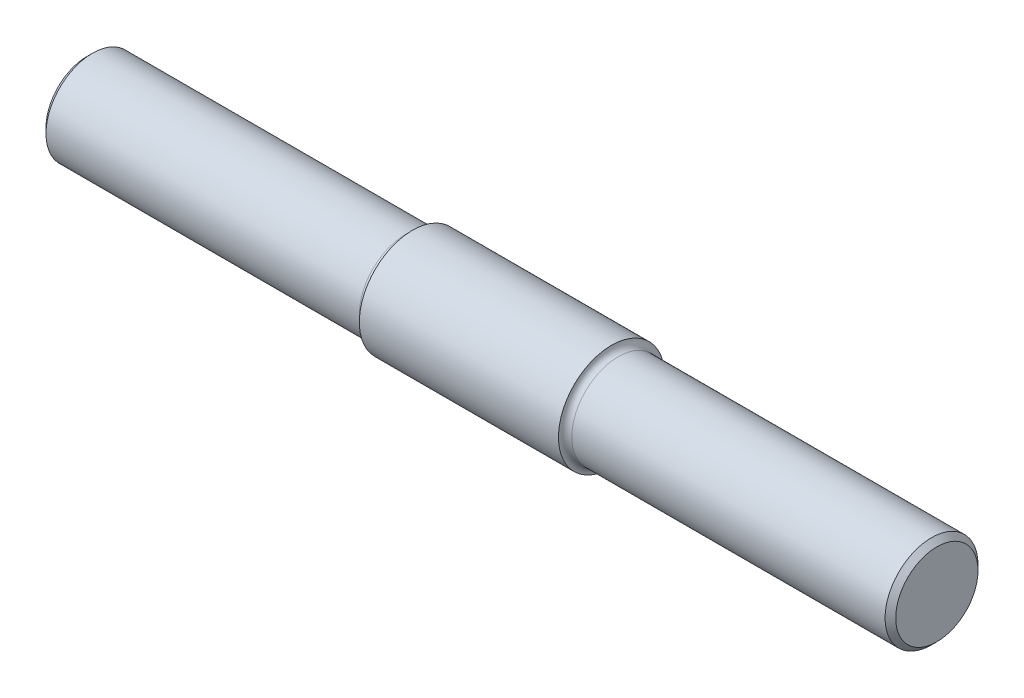
ISO-10303-21;
HEADER;
FILE_DESCRIPTION(('STEP AP214'),'2;1');
FILE_NAME('part.step','',(''),(''),'','','');
FILE_SCHEMA(('AUTOMOTIVE_DESIGN { 1 0 10303 214 1 1 1 1 }'));
ENDSEC;
DATA;
#1=APPLICATION_CONTEXT('core data for automotive mechanical design processes');
#2=APPLICATION_PROTOCOL_DEFINITION('international standard','automotive_design',2000,#1);
#3=PRODUCT_CONTEXT('',#1,'mechanical');
#4=PRODUCT('Part','Part','',(#3));
#5=PRODUCT_RELATED_PRODUCT_CATEGORY('part','',(#4));
#6=PRODUCT_DEFINITION_FORMATION('','',#4);
#7=PRODUCT_DEFINITION_CONTEXT('part definition',#1,'design');
#8=PRODUCT_DEFINITION('design','',#6,#7);
#9=PRODUCT_DEFINITION_SHAPE('','',#8);
#10=(LENGTH_UNIT() NAMED_UNIT(*) SI_UNIT(.MILLI.,.METRE.));
#11=(NAMED_UNIT(*) PLANE_ANGLE_UNIT() SI_UNIT($,.RADIAN.));
#12=(NAMED_UNIT(*) SI_UNIT($,.STERADIAN.) SOLID_ANGLE_UNIT());
#13=UNCERTAINTY_MEASURE_WITH_UNIT(LENGTH_MEASURE(1.E-05),#10,'distance_accuracy_value','');
#14=(GEOMETRIC_REPRESENTATION_CONTEXT(3) GLOBAL_UNCERTAINTY_ASSIGNED_CONTEXT((#13)) GLOBAL_UNIT_ASSIGNED_CONTEXT((#10,
#11,#12)) REPRESENTATION_CONTEXT('',''));
#15=CARTESIAN_POINT('',(0.,0.,0.));
#16=DIRECTION('',(0.,0.,1.));
#17=DIRECTION('',(1.,0.,0.));
#18=AXIS2_PLACEMENT_3D('',#15,#16,#17);
#19=CARTESIAN_POINT('',(-50.8,0.,0.));
#20=DIRECTION('',(-1.,0.,0.));
#21=DIRECTION('',(0.,0.,1.));
#22=AXIS2_PLACEMENT_3D('',#19,#20,#21);
#23=PLANE('',#22);
#24=CARTESIAN_POINT('',(-50.8,0.,0.));
#25=DIRECTION('',(-1.,0.,0.));
#26=DIRECTION('',(0.,0.,1.));
#27=AXIS2_PLACEMENT_3D('',#24,#25,#26);
#28=CIRCLE('',#27,4.92125000000001);
#29=CARTESIAN_POINT('',(-50.8,0.,4.92125000000001));
#30=VERTEX_POINT('',#29);
#31=EDGE_CURVE('E10',#30,#30,#28,.T.);
#32=ORIENTED_EDGE('',*,*,#31,.T.);
#33=EDGE_LOOP('',(#32));
#34=FACE_BOUND('',#33,.T.);
#35=ADVANCED_FACE('F32',(#34),#23,.T.);
#36=CARTESIAN_POINT('',(50.8,5.55625000000001,0.));
#37=DIRECTION('',(1.,0.,0.));
#38=DIRECTION('',(0.,0.,-1.));
#39=AXIS2_PLACEMENT_3D('',#36,#37,#38);
#40=PLANE('',#39);
#41=CARTESIAN_POINT('',(50.8,0.,0.));
#42=DIRECTION('',(1.,0.,0.));
#43=DIRECTION('',(0.,0.,-1.));
#44=AXIS2_PLACEMENT_3D('',#41,#42,#43);
#45=CIRCLE('',#44,4.92125000000002);
#46=CARTESIAN_POINT('',(50.8,0.,-4.92125000000002));
#47=VERTEX_POINT('',#46);
#48=EDGE_CURVE('E47',#47,#47,#45,.T.);
#49=ORIENTED_EDGE('',*,*,#48,.T.);
#50=EDGE_LOOP('',(#49));
#51=FACE_BOUND('',#50,.T.);
#52=ADVANCED_FACE('F80',(#51),#40,.T.);
#53=CARTESIAN_POINT('',(-50.8,0.,0.));
#54=DIRECTION('',(1.,0.,0.));
#55=DIRECTION('',(0.,0.,-1.));
#56=AXIS2_PLACEMENT_3D('',#53,#54,#55);
#57=CYLINDRICAL_SURFACE('',#56,5.55625);
#58=CARTESIAN_POINT('',(50.165,0.,0.));
#59=DIRECTION('',(1.,0.,0.));
#60=DIRECTION('',(0.,0.,-1.));
#61=AXIS2_PLACEMENT_3D('',#58,#59,#60);
#62=CIRCLE('',#61,5.55625);
#63=CARTESIAN_POINT('',(50.165,0.,-5.55625));
#64=VERTEX_POINT('',#63);
#65=EDGE_CURVE('E43',#64,#64,#62,.F.);
#66=ORIENTED_EDGE('',*,*,#65,.T.);
#67=EDGE_LOOP('',(#66));
#68=FACE_BOUND('',#67,.T.);
#69=CARTESIAN_POINT('',(12.7,0.,0.));
#70=DIRECTION('',(1.,0.,0.));
#71=DIRECTION('',(0.,0.,-1.));
#72=AXIS2_PLACEMENT_3D('',#69,#70,#71);
#73=CIRCLE('',#72,5.55625);
#74=CARTESIAN_POINT('',(12.7,0.,-5.55625));
#75=VERTEX_POINT('',#74);
#76=EDGE_CURVE('E52',#75,#75,#73,.T.);
#77=ORIENTED_EDGE('',*,*,#76,.T.);
#78=EDGE_LOOP('',(#77));
#79=FACE_BOUND('',#78,.T.);
#80=ADVANCED_FACE('F85',(#68,#79),#57,.T.);
#81=CARTESIAN_POINT('',(12.7,0.,0.));
#82=DIRECTION('',(1.,0.,0.));
#83=DIRECTION('',(0.,0.,-1.));
#84=AXIS2_PLACEMENT_3D('',#81,#82,#83);
#85=TOROIDAL_SURFACE('',#84,6.35,0.793750000000004);
#86=CARTESIAN_POINT('',(11.90625,0.,0.));
#87=DIRECTION('',(1.,0.,0.));
#88=DIRECTION('',(0.,0.,-1.));
#89=AXIS2_PLACEMENT_3D('',#86,#87,#88);
#90=CIRCLE('',#89,6.35000000000001);
#91=CARTESIAN_POINT('',(11.90625,0.,-6.35000000000001));
#92=VERTEX_POINT('',#91);
#93=EDGE_CURVE('E55',#92,#92,#90,.T.);
#94=ORIENTED_EDGE('',*,*,#93,.T.);
#95=EDGE_LOOP('',(#94));
#96=FACE_BOUND('',#95,.T.);
#97=ORIENTED_EDGE('',*,*,#76,.F.);
#98=EDGE_LOOP('',(#97));
#99=FACE_BOUND('',#98,.T.);
#100=ADVANCED_FACE('F91',(#96,#99),#85,.F.);
#101=CARTESIAN_POINT('',(-50.8,0.,0.));
#102=DIRECTION('',(1.,0.,0.));
#103=DIRECTION('',(0.,0.,-1.));
#104=AXIS2_PLACEMENT_3D('',#101,#102,#103);
#105=CYLINDRICAL_SURFACE('',#104,6.35000000000001);
#106=CARTESIAN_POINT('',(-11.90625,0.,0.));
#107=DIRECTION('',(1.,0.,0.));
#108=DIRECTION('',(0.,0.,-1.));
#109=AXIS2_PLACEMENT_3D('',#106,#107,#108);
#110=CIRCLE('',#109,6.35000000000001);
#111=CARTESIAN_POINT('',(-11.90625,0.,-6.35000000000001));
#112=VERTEX_POINT('',#111);
#113=EDGE_CURVE('E58',#112,#112,#110,.T.);
#114=ORIENTED_EDGE('',*,*,#113,.T.);
#115=EDGE_LOOP('',(#114));
#116=FACE_BOUND('',#115,.T.);
#117=ORIENTED_EDGE('',*,*,#93,.F.);
#118=EDGE_LOOP('',(#117));
#119=FACE_BOUND('',#118,.T.);
#120=ADVANCED_FACE('F77',(#116,#119),#105,.T.);
#121=CARTESIAN_POINT('',(-12.7,0.,0.));
#122=DIRECTION('',(1.,0.,0.));
#123=DIRECTION('',(0.,0.,-1.));
#124=AXIS2_PLACEMENT_3D('',#121,#122,#123);
#125=TOROIDAL_SURFACE('',#124,6.35000000000001,0.793750000000004);
#126=CARTESIAN_POINT('',(-12.7,0.,0.));
#127=DIRECTION('',(1.,0.,0.));
#128=DIRECTION('',(0.,0.,-1.));
#129=AXIS2_PLACEMENT_3D('',#126,#127,#128);
#130=CIRCLE('',#129,5.55625);
#131=CARTESIAN_POINT('',(-12.7,0.,-5.55625));
#132=VERTEX_POINT('',#131);
#133=EDGE_CURVE('E61',#132,#132,#130,.T.);
#134=ORIENTED_EDGE('',*,*,#133,.T.);
#135=EDGE_LOOP('',(#134));
#136=FACE_BOUND('',#135,.T.);
#137=ORIENTED_EDGE('',*,*,#113,.F.);
#138=EDGE_LOOP('',(#137));
#139=FACE_BOUND('',#138,.T.);
#140=ADVANCED_FACE('F65',(#136,#139),#125,.F.);
#141=CARTESIAN_POINT('',(-50.8,0.,0.));
#142=DIRECTION('',(1.,0.,0.));
#143=DIRECTION('',(0.,0.,-1.));
#144=AXIS2_PLACEMENT_3D('',#141,#142,#143);
#145=CYLINDRICAL_SURFACE('',#144,5.55625000000001);
#146=CARTESIAN_POINT('',(-50.165,0.,0.));
#147=DIRECTION('',(-1.,0.,0.));
#148=DIRECTION('',(0.,0.,1.));
#149=AXIS2_PLACEMENT_3D('',#146,#147,#148);
#150=CIRCLE('',#149,5.55625000000001);
#151=CARTESIAN_POINT('',(-50.165,0.,5.55625000000001));
#152=VERTEX_POINT('',#151);
#153=EDGE_CURVE('E39',#152,#152,#150,.F.);
#154=ORIENTED_EDGE('',*,*,#153,.T.);
#155=EDGE_LOOP('',(#154));
#156=FACE_BOUND('',#155,.T.);
#157=ORIENTED_EDGE('',*,*,#133,.F.);
#158=EDGE_LOOP('',(#157));
#159=FACE_BOUND('',#158,.T.);
#160=ADVANCED_FACE('F68',(#156,#159),#145,.T.);
#161=CARTESIAN_POINT('',(50.8,0.,0.));
#162=DIRECTION('',(-1.,0.,0.));
#163=DIRECTION('',(0.,0.,1.));
#164=AXIS2_PLACEMENT_3D('',#161,#162,#163);
#165=CONICAL_SURFACE('',#164,4.92125000000002,0.785398163397441);
#166=ORIENTED_EDGE('',*,*,#65,.F.);
#167=EDGE_LOOP('',(#166));
#168=FACE_BOUND('',#167,.T.);
#169=ORIENTED_EDGE('',*,*,#48,.F.);
#170=EDGE_LOOP('',(#169));
#171=FACE_BOUND('',#170,.T.);
#172=ADVANCED_FACE('F70',(#168,#171),#165,.T.);
#173=CARTESIAN_POINT('',(-50.165,0.,0.));
#174=DIRECTION('',(1.,0.,0.));
#175=DIRECTION('',(0.,0.,-1.));
#176=AXIS2_PLACEMENT_3D('',#173,#174,#175);
#177=CONICAL_SURFACE('',#176,5.55625000000001,0.785398163397454);
#178=ORIENTED_EDGE('',*,*,#31,.F.);
#179=EDGE_LOOP('',(#178));
#180=FACE_BOUND('',#179,.T.);
#181=ORIENTED_EDGE('',*,*,#153,.F.);
#182=EDGE_LOOP('',(#181));
#183=FACE_BOUND('',#182,.T.);
#184=ADVANCED_FACE('F34',(#180,#183),#177,.T.);
#185=CLOSED_SHELL('',(#35,#52,#80,#100,#120,#140,#160,#172,#184));
#186=MANIFOLD_SOLID_BREP('B2',#185);
#187=ADVANCED_BREP_SHAPE_REPRESENTATION('',(#18,#186),#14);
#188=SHAPE_DEFINITION_REPRESENTATION(#9,#187);
ENDSEC;
END-ISO-10303-21;
